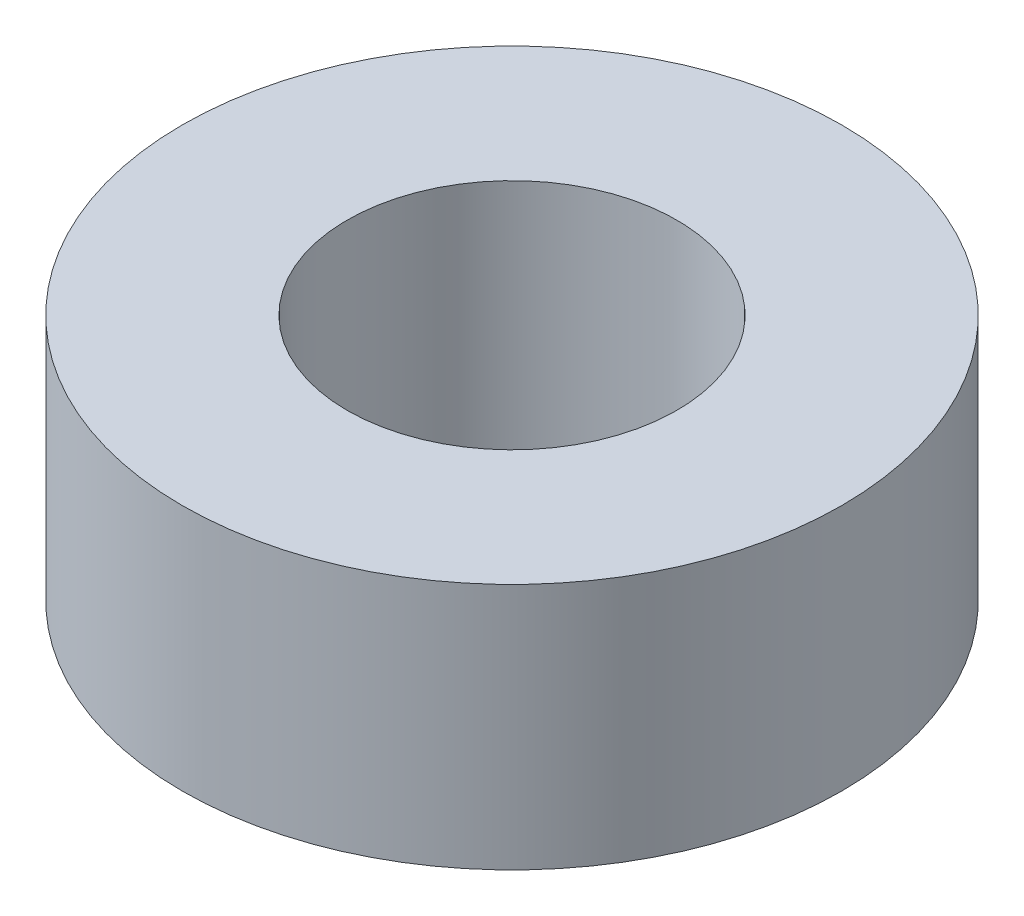
ISO-10303-21;
HEADER;
FILE_DESCRIPTION(('STEP AP214'),'2;1');
FILE_NAME('part.step','',(''),(''),'','','');
FILE_SCHEMA(('AUTOMOTIVE_DESIGN { 1 0 10303 214 1 1 1 1 }'));
ENDSEC;
DATA;
#1=APPLICATION_CONTEXT('core data for automotive mechanical design processes');
#2=APPLICATION_PROTOCOL_DEFINITION('international standard','automotive_design',2000,#1);
#3=PRODUCT_CONTEXT('',#1,'mechanical');
#4=PRODUCT('Part','Part','',(#3));
#5=PRODUCT_RELATED_PRODUCT_CATEGORY('part','',(#4));
#6=PRODUCT_DEFINITION_FORMATION('','',#4);
#7=PRODUCT_DEFINITION_CONTEXT('part definition',#1,'design');
#8=PRODUCT_DEFINITION('design','',#6,#7);
#9=PRODUCT_DEFINITION_SHAPE('','',#8);
#10=(LENGTH_UNIT() NAMED_UNIT(*) SI_UNIT(.MILLI.,.METRE.));
#11=(NAMED_UNIT(*) PLANE_ANGLE_UNIT() SI_UNIT($,.RADIAN.));
#12=(NAMED_UNIT(*) SI_UNIT($,.STERADIAN.) SOLID_ANGLE_UNIT());
#13=UNCERTAINTY_MEASURE_WITH_UNIT(LENGTH_MEASURE(1.E-05),#10,'distance_accuracy_value','');
#14=(GEOMETRIC_REPRESENTATION_CONTEXT(3) GLOBAL_UNCERTAINTY_ASSIGNED_CONTEXT((#13)) GLOBAL_UNIT_ASSIGNED_CONTEXT((#10,
#11,#12)) REPRESENTATION_CONTEXT('',''));
#15=CARTESIAN_POINT('',(0.,0.,0.));
#16=DIRECTION('',(0.,0.,1.));
#17=DIRECTION('',(1.,0.,0.));
#18=AXIS2_PLACEMENT_3D('',#15,#16,#17);
#19=CARTESIAN_POINT('',(0.,4.7625,0.));
#20=DIRECTION('',(0.,1.,0.));
#21=DIRECTION('',(0.,0.,1.));
#22=AXIS2_PLACEMENT_3D('',#19,#20,#21);
#23=PLANE('',#22);
#24=CARTESIAN_POINT('',(0.,4.7625,0.));
#25=DIRECTION('',(0.,1.,0.));
#26=DIRECTION('',(0.,0.,1.));
#27=AXIS2_PLACEMENT_3D('',#24,#25,#26);
#28=CIRCLE('',#27,6.35);
#29=CARTESIAN_POINT('',(0.,4.7625,6.35));
#30=VERTEX_POINT('',#29);
#31=EDGE_CURVE('E10',#30,#30,#28,.T.);
#32=ORIENTED_EDGE('',*,*,#31,.T.);
#33=EDGE_LOOP('',(#32));
#34=FACE_BOUND('',#33,.T.);
#35=CARTESIAN_POINT('',(0.,4.7625,0.));
#36=DIRECTION('',(0.,1.,0.));
#37=DIRECTION('',(0.,0.,1.));
#38=AXIS2_PLACEMENT_3D('',#35,#36,#37);
#39=CIRCLE('',#38,3.175);
#40=CARTESIAN_POINT('',(0.,4.7625,3.175));
#41=VERTEX_POINT('',#40);
#42=EDGE_CURVE('E48',#41,#41,#39,.T.);
#43=ORIENTED_EDGE('',*,*,#42,.F.);
#44=EDGE_LOOP('',(#43));
#45=FACE_BOUND('',#44,.T.);
#46=ADVANCED_FACE('F37',(#34,#45),#23,.T.);
#47=CARTESIAN_POINT('',(0.,0.,0.));
#48=DIRECTION('',(0.,1.,0.));
#49=DIRECTION('',(0.,0.,1.));
#50=AXIS2_PLACEMENT_3D('',#47,#48,#49);
#51=PLANE('',#50);
#52=CARTESIAN_POINT('',(0.,0.,0.));
#53=DIRECTION('',(0.,1.,0.));
#54=DIRECTION('',(0.,0.,1.));
#55=AXIS2_PLACEMENT_3D('',#52,#53,#54);
#56=CIRCLE('',#55,6.35);
#57=CARTESIAN_POINT('',(0.,0.,6.35));
#58=VERTEX_POINT('',#57);
#59=EDGE_CURVE('E41',#58,#58,#56,.T.);
#60=ORIENTED_EDGE('',*,*,#59,.F.);
#61=EDGE_LOOP('',(#60));
#62=FACE_BOUND('',#61,.T.);
#63=CARTESIAN_POINT('',(0.,0.,0.));
#64=DIRECTION('',(0.,1.,0.));
#65=DIRECTION('',(0.,0.,1.));
#66=AXIS2_PLACEMENT_3D('',#63,#64,#65);
#67=CIRCLE('',#66,3.175);
#68=CARTESIAN_POINT('',(0.,0.,3.175));
#69=VERTEX_POINT('',#68);
#70=EDGE_CURVE('E50',#69,#69,#67,.T.);
#71=ORIENTED_EDGE('',*,*,#70,.T.);
#72=EDGE_LOOP('',(#71));
#73=FACE_BOUND('',#72,.T.);
#74=ADVANCED_FACE('F60',(#62,#73),#51,.F.);
#75=CARTESIAN_POINT('',(0.,4.7625,0.));
#76=DIRECTION('',(0.,-1.,0.));
#77=DIRECTION('',(0.,0.,-1.));
#78=AXIS2_PLACEMENT_3D('',#75,#76,#77);
#79=CYLINDRICAL_SURFACE('',#78,6.35);
#80=ORIENTED_EDGE('',*,*,#31,.F.);
#81=EDGE_LOOP('',(#80));
#82=FACE_BOUND('',#81,.T.);
#83=ORIENTED_EDGE('',*,*,#59,.T.);
#84=EDGE_LOOP('',(#83));
#85=FACE_BOUND('',#84,.T.);
#86=ADVANCED_FACE('F39',(#82,#85),#79,.T.);
#87=CARTESIAN_POINT('',(0.,4.7625,0.));
#88=DIRECTION('',(0.,-1.,0.));
#89=DIRECTION('',(0.,0.,-1.));
#90=AXIS2_PLACEMENT_3D('',#87,#88,#89);
#91=CYLINDRICAL_SURFACE('',#90,3.175);
#92=ORIENTED_EDGE('',*,*,#42,.T.);
#93=EDGE_LOOP('',(#92));
#94=FACE_BOUND('',#93,.T.);
#95=ORIENTED_EDGE('',*,*,#70,.F.);
#96=EDGE_LOOP('',(#95));
#97=FACE_BOUND('',#96,.T.);
#98=ADVANCED_FACE('F56',(#94,#97),#91,.F.);
#99=CLOSED_SHELL('',(#46,#74,#86,#98));
#100=MANIFOLD_SOLID_BREP('B2',#99);
#101=ADVANCED_BREP_SHAPE_REPRESENTATION('',(#18,#100),#14);
#102=SHAPE_DEFINITION_REPRESENTATION(#9,#101);
ENDSEC;
END-ISO-10303-21;
